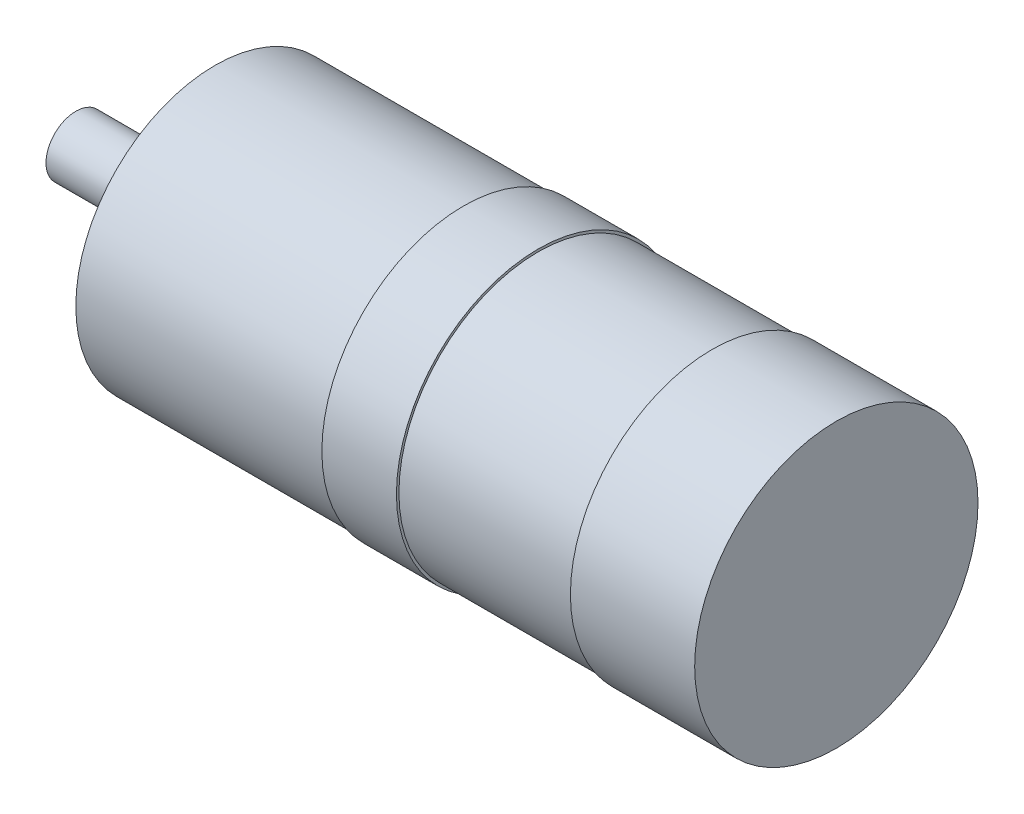
ISO-10303-21;
HEADER;
FILE_DESCRIPTION(('STEP AP214'),'2;1');
FILE_NAME('part.step','',(''),(''),'','','');
FILE_SCHEMA(('AUTOMOTIVE_DESIGN { 1 0 10303 214 1 1 1 1 }'));
ENDSEC;
DATA;
#1=APPLICATION_CONTEXT('core data for automotive mechanical design processes');
#2=APPLICATION_PROTOCOL_DEFINITION('international standard','automotive_design',2000,#1);
#3=PRODUCT_CONTEXT('',#1,'mechanical');
#4=PRODUCT('Part','Part','',(#3));
#5=PRODUCT_RELATED_PRODUCT_CATEGORY('part','',(#4));
#6=PRODUCT_DEFINITION_FORMATION('','',#4);
#7=PRODUCT_DEFINITION_CONTEXT('part definition',#1,'design');
#8=PRODUCT_DEFINITION('design','',#6,#7);
#9=PRODUCT_DEFINITION_SHAPE('','',#8);
#10=(LENGTH_UNIT() NAMED_UNIT(*) SI_UNIT(.MILLI.,.METRE.));
#11=(NAMED_UNIT(*) PLANE_ANGLE_UNIT() SI_UNIT($,.RADIAN.));
#12=(NAMED_UNIT(*) SI_UNIT($,.STERADIAN.) SOLID_ANGLE_UNIT());
#13=UNCERTAINTY_MEASURE_WITH_UNIT(LENGTH_MEASURE(1.E-05),#10,'distance_accuracy_value','');
#14=(GEOMETRIC_REPRESENTATION_CONTEXT(3) GLOBAL_UNCERTAINTY_ASSIGNED_CONTEXT((#13)) GLOBAL_UNIT_ASSIGNED_CONTEXT((#10,
#11,#12)) REPRESENTATION_CONTEXT('',''));
#15=CARTESIAN_POINT('',(0.,0.,0.));
#16=DIRECTION('',(0.,0.,1.));
#17=DIRECTION('',(1.,0.,0.));
#18=AXIS2_PLACEMENT_3D('',#15,#16,#17);
#19=CARTESIAN_POINT('',(-903.237381768934,0.,0.));
#20=DIRECTION('',(-1.,0.,0.));
#21=DIRECTION('',(0.,0.,1.));
#22=AXIS2_PLACEMENT_3D('',#19,#20,#21);
#23=CYLINDRICAL_SURFACE('',#22,6.);
#24=CARTESIAN_POINT('',(0.,0.,0.));
#25=DIRECTION('',(-1.,0.,0.));
#26=DIRECTION('',(0.,0.,1.));
#27=AXIS2_PLACEMENT_3D('',#24,#25,#26);
#28=CIRCLE('',#27,6.);
#29=CARTESIAN_POINT('',(0.,0.,6.));
#30=VERTEX_POINT('',#29);
#31=EDGE_CURVE('E64',#30,#30,#28,.T.);
#32=ORIENTED_EDGE('',*,*,#31,.F.);
#33=EDGE_LOOP('',(#32));
#34=FACE_BOUND('',#33,.T.);
#35=CARTESIAN_POINT('',(16.,0.,0.));
#36=DIRECTION('',(1.,0.,0.));
#37=DIRECTION('',(0.,0.,-1.));
#38=AXIS2_PLACEMENT_3D('',#35,#36,#37);
#39=CIRCLE('',#38,6.);
#40=CARTESIAN_POINT('',(16.,6.,0.));
#41=VERTEX_POINT('',#40);
#42=CARTESIAN_POINT('',(16.,-6.,0.));
#43=VERTEX_POINT('',#42);
#44=EDGE_CURVE('E11',#41,#43,#39,.T.);
#45=ORIENTED_EDGE('',*,*,#44,.F.);
#46=EDGE_CURVE('E49',#43,#41,#39,.T.);
#47=ORIENTED_EDGE('',*,*,#46,.F.);
#48=EDGE_LOOP('',(#45,#47));
#49=FACE_BOUND('',#48,.T.);
#50=ADVANCED_FACE('F45',(#34,#49),#23,.T.);
#51=CARTESIAN_POINT('',(0.,0.,0.));
#52=DIRECTION('',(1.,0.,0.));
#53=DIRECTION('',(0.,0.,-1.));
#54=AXIS2_PLACEMENT_3D('',#51,#52,#53);
#55=PLANE('',#54);
#56=ORIENTED_EDGE('',*,*,#31,.T.);
#57=EDGE_LOOP('',(#56));
#58=FACE_BOUND('',#57,.T.);
#59=ADVANCED_FACE('F47',(#58),#55,.F.);
#60=ORIENTED_EDGE('',*,*,#46,.T.);
#61=ORIENTED_EDGE('',*,*,#44,.T.);
#62=EDGE_LOOP('',(#60,#61));
#63=FACE_BOUND('',#62,.T.);
#64=CARTESIAN_POINT('',(26.,0.,0.));
#65=DIRECTION('',(-1.,0.,0.));
#66=DIRECTION('',(0.,0.,1.));
#67=AXIS2_PLACEMENT_3D('',#64,#65,#66);
#68=CIRCLE('',#67,6.);
#69=CARTESIAN_POINT('',(26.,0.,6.));
#70=VERTEX_POINT('',#69);
#71=EDGE_CURVE('E68',#70,#70,#68,.T.);
#72=ORIENTED_EDGE('',*,*,#71,.T.);
#73=EDGE_LOOP('',(#72));
#74=FACE_BOUND('',#73,.T.);
#75=ADVANCED_FACE('F61',(#63,#74),#23,.T.);
#76=CARTESIAN_POINT('',(26.,6.,0.));
#77=DIRECTION('',(1.,0.,0.));
#78=DIRECTION('',(0.,0.,-1.));
#79=AXIS2_PLACEMENT_3D('',#76,#77,#78);
#80=PLANE('',#79);
#81=ORIENTED_EDGE('',*,*,#71,.F.);
#82=EDGE_LOOP('',(#81));
#83=FACE_BOUND('',#82,.T.);
#84=CARTESIAN_POINT('',(26.,0.,0.));
#85=DIRECTION('',(-1.,0.,0.));
#86=DIRECTION('',(0.,0.,1.));
#87=AXIS2_PLACEMENT_3D('',#84,#85,#86);
#88=CIRCLE('',#87,16.);
#89=CARTESIAN_POINT('',(26.,0.,16.));
#90=VERTEX_POINT('',#89);
#91=EDGE_CURVE('E72',#90,#90,#88,.T.);
#92=ORIENTED_EDGE('',*,*,#91,.T.);
#93=EDGE_LOOP('',(#92));
#94=FACE_BOUND('',#93,.T.);
#95=ADVANCED_FACE('F203',(#83,#94),#80,.F.);
#96=CARTESIAN_POINT('',(-903.237381768934,0.,0.));
#97=DIRECTION('',(-1.,0.,0.));
#98=DIRECTION('',(0.,0.,1.));
#99=AXIS2_PLACEMENT_3D('',#96,#97,#98);
#100=CYLINDRICAL_SURFACE('',#99,16.);
#101=ORIENTED_EDGE('',*,*,#91,.F.);
#102=EDGE_LOOP('',(#101));
#103=FACE_BOUND('',#102,.T.);
#104=CARTESIAN_POINT('',(28.,0.,0.));
#105=DIRECTION('',(-1.,0.,0.));
#106=DIRECTION('',(0.,0.,1.));
#107=AXIS2_PLACEMENT_3D('',#104,#105,#106);
#108=CIRCLE('',#107,16.);
#109=CARTESIAN_POINT('',(28.,0.,16.));
#110=VERTEX_POINT('',#109);
#111=EDGE_CURVE('E77',#110,#110,#108,.T.);
#112=ORIENTED_EDGE('',*,*,#111,.T.);
#113=EDGE_LOOP('',(#112));
#114=FACE_BOUND('',#113,.T.);
#115=ADVANCED_FACE('F135',(#103,#114),#100,.T.);
#116=CARTESIAN_POINT('',(28.,16.,0.));
#117=DIRECTION('',(1.,0.,0.));
#118=DIRECTION('',(0.,0.,-1.));
#119=AXIS2_PLACEMENT_3D('',#116,#117,#118);
#120=PLANE('',#119);
#121=CARTESIAN_POINT('',(28.,-15.9099025766973,-15.9099025766973));
#122=DIRECTION('',(-1.,0.,0.));
#123=DIRECTION('',(0.,0.,1.));
#124=AXIS2_PLACEMENT_3D('',#121,#122,#123);
#125=CIRCLE('',#124,2.1);
#126=CARTESIAN_POINT('',(28.,-15.9099025766973,-13.8099025766973));
#127=VERTEX_POINT('',#126);
#128=EDGE_CURVE('E114',#127,#127,#125,.T.);
#129=ORIENTED_EDGE('',*,*,#128,.F.);
#130=EDGE_LOOP('',(#129));
#131=FACE_BOUND('',#130,.T.);
#132=CARTESIAN_POINT('',(28.,-15.9099025766973,15.9099025766973));
#133=DIRECTION('',(-1.,0.,0.));
#134=DIRECTION('',(0.,0.,1.));
#135=AXIS2_PLACEMENT_3D('',#132,#133,#134);
#136=CIRCLE('',#135,2.1);
#137=CARTESIAN_POINT('',(28.,-15.9099025766973,18.0099025766973));
#138=VERTEX_POINT('',#137);
#139=EDGE_CURVE('E120',#138,#138,#136,.T.);
#140=ORIENTED_EDGE('',*,*,#139,.F.);
#141=EDGE_LOOP('',(#140));
#142=FACE_BOUND('',#141,.T.);
#143=CARTESIAN_POINT('',(28.,15.9099025766973,15.9099025766973));
#144=DIRECTION('',(-1.,0.,0.));
#145=DIRECTION('',(0.,0.,1.));
#146=AXIS2_PLACEMENT_3D('',#143,#144,#145);
#147=CIRCLE('',#146,2.1);
#148=CARTESIAN_POINT('',(28.,15.9099025766973,18.0099025766973));
#149=VERTEX_POINT('',#148);
#150=EDGE_CURVE('E108',#149,#149,#147,.T.);
#151=ORIENTED_EDGE('',*,*,#150,.F.);
#152=EDGE_LOOP('',(#151));
#153=FACE_BOUND('',#152,.T.);
#154=CARTESIAN_POINT('',(28.,15.9099025766973,-15.9099025766973));
#155=DIRECTION('',(-1.,0.,0.));
#156=DIRECTION('',(0.,0.,1.));
#157=AXIS2_PLACEMENT_3D('',#154,#155,#156);
#158=CIRCLE('',#157,2.1);
#159=CARTESIAN_POINT('',(28.,15.9099025766973,-13.8099025766973));
#160=VERTEX_POINT('',#159);
#161=EDGE_CURVE('E105',#160,#160,#158,.T.);
#162=ORIENTED_EDGE('',*,*,#161,.F.);
#163=EDGE_LOOP('',(#162));
#164=FACE_BOUND('',#163,.T.);
#165=ORIENTED_EDGE('',*,*,#111,.F.);
#166=EDGE_LOOP('',(#165));
#167=FACE_BOUND('',#166,.T.);
#168=CARTESIAN_POINT('',(28.,0.,0.));
#169=DIRECTION('',(-1.,0.,0.));
#170=DIRECTION('',(0.,0.,1.));
#171=AXIS2_PLACEMENT_3D('',#168,#169,#170);
#172=CIRCLE('',#171,28.);
#173=CARTESIAN_POINT('',(28.,0.,28.));
#174=VERTEX_POINT('',#173);
#175=EDGE_CURVE('E80',#174,#174,#172,.T.);
#176=ORIENTED_EDGE('',*,*,#175,.T.);
#177=EDGE_LOOP('',(#176));
#178=FACE_BOUND('',#177,.T.);
#179=ADVANCED_FACE('F131',(#131,#142,#153,#164,#167,#178),#120,.F.);
#180=CARTESIAN_POINT('',(-903.237381768934,0.,0.));
#181=DIRECTION('',(-1.,0.,0.));
#182=DIRECTION('',(0.,0.,1.));
#183=AXIS2_PLACEMENT_3D('',#180,#181,#182);
#184=CYLINDRICAL_SURFACE('',#183,28.);
#185=ORIENTED_EDGE('',*,*,#175,.F.);
#186=EDGE_LOOP('',(#185));
#187=FACE_BOUND('',#186,.T.);
#188=CARTESIAN_POINT('',(78.,0.,0.));
#189=DIRECTION('',(-1.,0.,0.));
#190=DIRECTION('',(0.,0.,1.));
#191=AXIS2_PLACEMENT_3D('',#188,#189,#190);
#192=CIRCLE('',#191,28.);
#193=CARTESIAN_POINT('',(78.,0.,28.));
#194=VERTEX_POINT('',#193);
#195=EDGE_CURVE('E83',#194,#194,#192,.T.);
#196=ORIENTED_EDGE('',*,*,#195,.T.);
#197=EDGE_LOOP('',(#196));
#198=FACE_BOUND('',#197,.T.);
#199=ADVANCED_FACE('F134',(#187,#198),#184,.T.);
#200=CARTESIAN_POINT('',(78.,28.,0.));
#201=DIRECTION('',(1.,0.,0.));
#202=DIRECTION('',(0.,0.,-1.));
#203=AXIS2_PLACEMENT_3D('',#200,#201,#202);
#204=PLANE('',#203);
#205=ORIENTED_EDGE('',*,*,#195,.F.);
#206=EDGE_LOOP('',(#205));
#207=FACE_BOUND('',#206,.T.);
#208=CARTESIAN_POINT('',(78.,0.,0.));
#209=DIRECTION('',(-1.,0.,0.));
#210=DIRECTION('',(0.,0.,1.));
#211=AXIS2_PLACEMENT_3D('',#208,#209,#210);
#212=CIRCLE('',#211,28.5);
#213=CARTESIAN_POINT('',(78.,0.,28.5));
#214=VERTEX_POINT('',#213);
#215=EDGE_CURVE('E86',#214,#214,#212,.T.);
#216=ORIENTED_EDGE('',*,*,#215,.T.);
#217=EDGE_LOOP('',(#216));
#218=FACE_BOUND('',#217,.T.);
#219=ADVANCED_FACE('F146',(#207,#218),#204,.F.);
#220=CARTESIAN_POINT('',(-903.237381768934,0.,0.));
#221=DIRECTION('',(-1.,0.,0.));
#222=DIRECTION('',(0.,0.,1.));
#223=AXIS2_PLACEMENT_3D('',#220,#221,#222);
#224=CYLINDRICAL_SURFACE('',#223,28.5);
#225=ORIENTED_EDGE('',*,*,#215,.F.);
#226=EDGE_LOOP('',(#225));
#227=FACE_BOUND('',#226,.T.);
#228=CARTESIAN_POINT('',(93.,0.,0.));
#229=DIRECTION('',(-1.,0.,0.));
#230=DIRECTION('',(0.,0.,1.));
#231=AXIS2_PLACEMENT_3D('',#228,#229,#230);
#232=CIRCLE('',#231,28.5);
#233=CARTESIAN_POINT('',(93.,0.,28.5));
#234=VERTEX_POINT('',#233);
#235=EDGE_CURVE('E89',#234,#234,#232,.T.);
#236=ORIENTED_EDGE('',*,*,#235,.T.);
#237=EDGE_LOOP('',(#236));
#238=FACE_BOUND('',#237,.T.);
#239=ADVANCED_FACE('F152',(#227,#238),#224,.T.);
#240=CARTESIAN_POINT('',(93.,28.5,0.));
#241=DIRECTION('',(-1.,0.,0.));
#242=DIRECTION('',(0.,0.,1.));
#243=AXIS2_PLACEMENT_3D('',#240,#241,#242);
#244=PLANE('',#243);
#245=ORIENTED_EDGE('',*,*,#235,.F.);
#246=EDGE_LOOP('',(#245));
#247=FACE_BOUND('',#246,.T.);
#248=CARTESIAN_POINT('',(93.,0.,0.));
#249=DIRECTION('',(-1.,0.,0.));
#250=DIRECTION('',(0.,0.,1.));
#251=AXIS2_PLACEMENT_3D('',#248,#249,#250);
#252=CIRCLE('',#251,28.);
#253=CARTESIAN_POINT('',(93.,0.,28.));
#254=VERTEX_POINT('',#253);
#255=EDGE_CURVE('E92',#254,#254,#252,.T.);
#256=ORIENTED_EDGE('',*,*,#255,.T.);
#257=EDGE_LOOP('',(#256));
#258=FACE_BOUND('',#257,.T.);
#259=ADVANCED_FACE('F158',(#247,#258),#244,.F.);
#260=CARTESIAN_POINT('',(-903.237381768934,0.,0.));
#261=DIRECTION('',(-1.,0.,0.));
#262=DIRECTION('',(0.,0.,1.));
#263=AXIS2_PLACEMENT_3D('',#260,#261,#262);
#264=CYLINDRICAL_SURFACE('',#263,28.);
#265=ORIENTED_EDGE('',*,*,#255,.F.);
#266=EDGE_LOOP('',(#265));
#267=FACE_BOUND('',#266,.T.);
#268=CARTESIAN_POINT('',(128.,0.,0.));
#269=DIRECTION('',(-1.,0.,0.));
#270=DIRECTION('',(0.,0.,1.));
#271=AXIS2_PLACEMENT_3D('',#268,#269,#270);
#272=CIRCLE('',#271,28.);
#273=CARTESIAN_POINT('',(128.,0.,28.));
#274=VERTEX_POINT('',#273);
#275=EDGE_CURVE('E95',#274,#274,#272,.T.);
#276=ORIENTED_EDGE('',*,*,#275,.T.);
#277=EDGE_LOOP('',(#276));
#278=FACE_BOUND('',#277,.T.);
#279=ADVANCED_FACE('F164',(#267,#278),#264,.T.);
#280=CARTESIAN_POINT('',(128.,28.,0.));
#281=DIRECTION('',(1.,0.,0.));
#282=DIRECTION('',(0.,0.,-1.));
#283=AXIS2_PLACEMENT_3D('',#280,#281,#282);
#284=PLANE('',#283);
#285=ORIENTED_EDGE('',*,*,#275,.F.);
#286=EDGE_LOOP('',(#285));
#287=FACE_BOUND('',#286,.T.);
#288=CARTESIAN_POINT('',(128.,0.,0.));
#289=DIRECTION('',(-1.,0.,0.));
#290=DIRECTION('',(0.,0.,1.));
#291=AXIS2_PLACEMENT_3D('',#288,#289,#290);
#292=CIRCLE('',#291,28.5);
#293=CARTESIAN_POINT('',(128.,0.,28.5));
#294=VERTEX_POINT('',#293);
#295=EDGE_CURVE('E98',#294,#294,#292,.T.);
#296=ORIENTED_EDGE('',*,*,#295,.T.);
#297=EDGE_LOOP('',(#296));
#298=FACE_BOUND('',#297,.T.);
#299=ADVANCED_FACE('F170',(#287,#298),#284,.F.);
#300=CARTESIAN_POINT('',(-903.237381768934,0.,0.));
#301=DIRECTION('',(-1.,0.,0.));
#302=DIRECTION('',(0.,0.,1.));
#303=AXIS2_PLACEMENT_3D('',#300,#301,#302);
#304=CYLINDRICAL_SURFACE('',#303,28.5);
#305=ORIENTED_EDGE('',*,*,#295,.F.);
#306=EDGE_LOOP('',(#305));
#307=FACE_BOUND('',#306,.T.);
#308=CARTESIAN_POINT('',(153.,0.,0.));
#309=DIRECTION('',(-1.,0.,0.));
#310=DIRECTION('',(0.,0.,1.));
#311=AXIS2_PLACEMENT_3D('',#308,#309,#310);
#312=CIRCLE('',#311,28.5);
#313=CARTESIAN_POINT('',(153.,0.,28.5));
#314=VERTEX_POINT('',#313);
#315=EDGE_CURVE('E101',#314,#314,#312,.T.);
#316=ORIENTED_EDGE('',*,*,#315,.T.);
#317=EDGE_LOOP('',(#316));
#318=FACE_BOUND('',#317,.T.);
#319=ADVANCED_FACE('F176',(#307,#318),#304,.T.);
#320=CARTESIAN_POINT('',(153.,28.5,0.));
#321=DIRECTION('',(-1.,0.,0.));
#322=DIRECTION('',(0.,0.,1.));
#323=AXIS2_PLACEMENT_3D('',#320,#321,#322);
#324=PLANE('',#323);
#325=ORIENTED_EDGE('',*,*,#315,.F.);
#326=EDGE_LOOP('',(#325));
#327=FACE_BOUND('',#326,.T.);
#328=ADVANCED_FACE('F182',(#327),#324,.F.);
#329=CARTESIAN_POINT('',(34.5,15.9099025766973,-15.9099025766973));
#330=DIRECTION('',(-1.,0.,0.));
#331=DIRECTION('',(0.,0.,1.));
#332=AXIS2_PLACEMENT_3D('',#329,#330,#331);
#333=CYLINDRICAL_SURFACE('',#332,2.1);
#334=CARTESIAN_POINT('',(34.5,15.9099025766973,-15.9099025766973));
#335=DIRECTION('',(-1.,0.,0.));
#336=DIRECTION('',(0.,0.,1.));
#337=AXIS2_PLACEMENT_3D('',#334,#335,#336);
#338=CIRCLE('',#337,2.1);
#339=CARTESIAN_POINT('',(34.5,15.9099025766973,-13.8099025766973));
#340=VERTEX_POINT('',#339);
#341=EDGE_CURVE('E104',#340,#340,#338,.T.);
#342=ORIENTED_EDGE('',*,*,#341,.F.);
#343=EDGE_LOOP('',(#342));
#344=FACE_BOUND('',#343,.T.);
#345=ORIENTED_EDGE('',*,*,#161,.T.);
#346=EDGE_LOOP('',(#345));
#347=FACE_BOUND('',#346,.T.);
#348=ADVANCED_FACE('F187',(#344,#347),#333,.F.);
#349=CARTESIAN_POINT('',(34.5,15.9099025766973,-15.9099025766973));
#350=DIRECTION('',(-1.,0.,0.));
#351=DIRECTION('',(0.,0.,1.));
#352=AXIS2_PLACEMENT_3D('',#349,#350,#351);
#353=PLANE('',#352);
#354=ORIENTED_EDGE('',*,*,#341,.T.);
#355=EDGE_LOOP('',(#354));
#356=FACE_BOUND('',#355,.T.);
#357=ADVANCED_FACE('F192',(#356),#353,.T.);
#358=CARTESIAN_POINT('',(34.5,15.9099025766973,15.9099025766973));
#359=DIRECTION('',(-1.,0.,0.));
#360=DIRECTION('',(0.,0.,1.));
#361=AXIS2_PLACEMENT_3D('',#358,#359,#360);
#362=CYLINDRICAL_SURFACE('',#361,2.1);
#363=CARTESIAN_POINT('',(34.5,15.9099025766973,15.9099025766973));
#364=DIRECTION('',(-1.,0.,0.));
#365=DIRECTION('',(0.,0.,1.));
#366=AXIS2_PLACEMENT_3D('',#363,#364,#365);
#367=CIRCLE('',#366,2.1);
#368=CARTESIAN_POINT('',(34.5,15.9099025766973,18.0099025766973));
#369=VERTEX_POINT('',#368);
#370=EDGE_CURVE('E123',#369,#369,#367,.T.);
#371=ORIENTED_EDGE('',*,*,#370,.F.);
#372=EDGE_LOOP('',(#371));
#373=FACE_BOUND('',#372,.T.);
#374=ORIENTED_EDGE('',*,*,#150,.T.);
#375=EDGE_LOOP('',(#374));
#376=FACE_BOUND('',#375,.T.);
#377=ADVANCED_FACE('F129',(#373,#376),#362,.F.);
#378=CARTESIAN_POINT('',(34.5,15.9099025766973,15.9099025766973));
#379=DIRECTION('',(-1.,0.,0.));
#380=DIRECTION('',(0.,0.,1.));
#381=AXIS2_PLACEMENT_3D('',#378,#379,#380);
#382=PLANE('',#381);
#383=ORIENTED_EDGE('',*,*,#370,.T.);
#384=EDGE_LOOP('',(#383));
#385=FACE_BOUND('',#384,.T.);
#386=ADVANCED_FACE('F284',(#385),#382,.T.);
#387=CARTESIAN_POINT('',(34.5,-15.9099025766973,15.9099025766973));
#388=DIRECTION('',(-1.,0.,0.));
#389=DIRECTION('',(0.,0.,1.));
#390=AXIS2_PLACEMENT_3D('',#387,#388,#389);
#391=CYLINDRICAL_SURFACE('',#390,2.1);
#392=CARTESIAN_POINT('',(34.5,-15.9099025766973,15.9099025766973));
#393=DIRECTION('',(-1.,0.,0.));
#394=DIRECTION('',(0.,0.,1.));
#395=AXIS2_PLACEMENT_3D('',#392,#393,#394);
#396=CIRCLE('',#395,2.1);
#397=CARTESIAN_POINT('',(34.5,-15.9099025766973,18.0099025766973));
#398=VERTEX_POINT('',#397);
#399=EDGE_CURVE('E117',#398,#398,#396,.T.);
#400=ORIENTED_EDGE('',*,*,#399,.F.);
#401=EDGE_LOOP('',(#400));
#402=FACE_BOUND('',#401,.T.);
#403=ORIENTED_EDGE('',*,*,#139,.T.);
#404=EDGE_LOOP('',(#403));
#405=FACE_BOUND('',#404,.T.);
#406=ADVANCED_FACE('F294',(#402,#405),#391,.F.);
#407=CARTESIAN_POINT('',(34.5,-15.9099025766973,15.9099025766973));
#408=DIRECTION('',(-1.,0.,0.));
#409=DIRECTION('',(0.,0.,1.));
#410=AXIS2_PLACEMENT_3D('',#407,#408,#409);
#411=PLANE('',#410);
#412=ORIENTED_EDGE('',*,*,#399,.T.);
#413=EDGE_LOOP('',(#412));
#414=FACE_BOUND('',#413,.T.);
#415=ADVANCED_FACE('F304',(#414),#411,.T.);
#416=CARTESIAN_POINT('',(34.5,-15.9099025766973,-15.9099025766973));
#417=DIRECTION('',(-1.,0.,0.));
#418=DIRECTION('',(0.,0.,1.));
#419=AXIS2_PLACEMENT_3D('',#416,#417,#418);
#420=CYLINDRICAL_SURFACE('',#419,2.1);
#421=CARTESIAN_POINT('',(34.5,-15.9099025766973,-15.9099025766973));
#422=DIRECTION('',(-1.,0.,0.));
#423=DIRECTION('',(0.,0.,1.));
#424=AXIS2_PLACEMENT_3D('',#421,#422,#423);
#425=CIRCLE('',#424,2.1);
#426=CARTESIAN_POINT('',(34.5,-15.9099025766973,-13.8099025766973));
#427=VERTEX_POINT('',#426);
#428=EDGE_CURVE('E111',#427,#427,#425,.T.);
#429=ORIENTED_EDGE('',*,*,#428,.F.);
#430=EDGE_LOOP('',(#429));
#431=FACE_BOUND('',#430,.T.);
#432=ORIENTED_EDGE('',*,*,#128,.T.);
#433=EDGE_LOOP('',(#432));
#434=FACE_BOUND('',#433,.T.);
#435=ADVANCED_FACE('F314',(#431,#434),#420,.F.);
#436=CARTESIAN_POINT('',(34.5,-15.9099025766973,-15.9099025766973));
#437=DIRECTION('',(-1.,0.,0.));
#438=DIRECTION('',(0.,0.,1.));
#439=AXIS2_PLACEMENT_3D('',#436,#437,#438);
#440=PLANE('',#439);
#441=ORIENTED_EDGE('',*,*,#428,.T.);
#442=EDGE_LOOP('',(#441));
#443=FACE_BOUND('',#442,.T.);
#444=ADVANCED_FACE('F324',(#443),#440,.T.);
#445=CLOSED_SHELL('',(#50,#59,#75,#95,#115,#179,#199,#219,#239,#259,#279,#299,#319,#328,#348,
#357,#377,#386,#406,#415,#435,#444));
#446=MANIFOLD_SOLID_BREP('B2',#445);
#447=ADVANCED_BREP_SHAPE_REPRESENTATION('',(#18,#446),#14);
#448=SHAPE_DEFINITION_REPRESENTATION(#9,#447);
ENDSEC;
END-ISO-10303-21;
